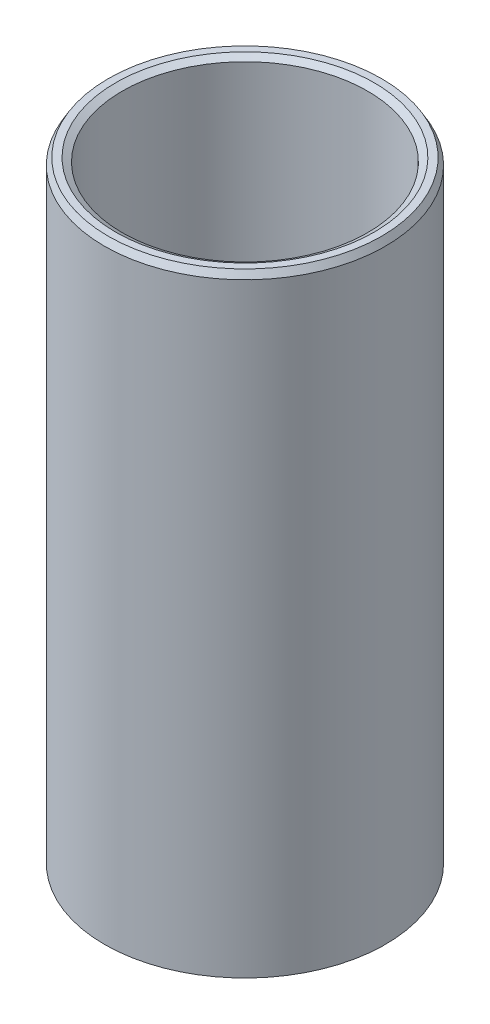
ISO-10303-21;
HEADER;
FILE_DESCRIPTION(('STEP AP214'),'2;1');
FILE_NAME('part.step','',(''),(''),'','','');
FILE_SCHEMA(('AUTOMOTIVE_DESIGN { 1 0 10303 214 1 1 1 1 }'));
ENDSEC;
DATA;
#1=APPLICATION_CONTEXT('core data for automotive mechanical design processes');
#2=APPLICATION_PROTOCOL_DEFINITION('international standard','automotive_design',2000,#1);
#3=PRODUCT_CONTEXT('',#1,'mechanical');
#4=PRODUCT('Part','Part','',(#3));
#5=PRODUCT_RELATED_PRODUCT_CATEGORY('part','',(#4));
#6=PRODUCT_DEFINITION_FORMATION('','',#4);
#7=PRODUCT_DEFINITION_CONTEXT('part definition',#1,'design');
#8=PRODUCT_DEFINITION('design','',#6,#7);
#9=PRODUCT_DEFINITION_SHAPE('','',#8);
#10=(LENGTH_UNIT() NAMED_UNIT(*) SI_UNIT(.MILLI.,.METRE.));
#11=(NAMED_UNIT(*) PLANE_ANGLE_UNIT() SI_UNIT($,.RADIAN.));
#12=(NAMED_UNIT(*) SI_UNIT($,.STERADIAN.) SOLID_ANGLE_UNIT());
#13=UNCERTAINTY_MEASURE_WITH_UNIT(LENGTH_MEASURE(1.E-05),#10,'distance_accuracy_value','');
#14=(GEOMETRIC_REPRESENTATION_CONTEXT(3) GLOBAL_UNCERTAINTY_ASSIGNED_CONTEXT((#13)) GLOBAL_UNIT_ASSIGNED_CONTEXT((#10,
#11,#12)) REPRESENTATION_CONTEXT('',''));
#15=CARTESIAN_POINT('',(0.,0.,0.));
#16=DIRECTION('',(0.,0.,1.));
#17=DIRECTION('',(1.,0.,0.));
#18=AXIS2_PLACEMENT_3D('',#15,#16,#17);
#19=CARTESIAN_POINT('',(0.,251.845150540965,0.));
#20=DIRECTION('',(0.,-1.,0.));
#21=DIRECTION('',(0.,0.,-1.));
#22=AXIS2_PLACEMENT_3D('',#19,#20,#21);
#23=CYLINDRICAL_SURFACE('',#22,57.5);
#24=CARTESIAN_POINT('',(0.,1.57675587139572,0.));
#25=DIRECTION('',(0.,1.,0.));
#26=DIRECTION('',(0.,0.,1.));
#27=AXIS2_PLACEMENT_3D('',#24,#25,#26);
#28=CIRCLE('',#27,57.5);
#29=CARTESIAN_POINT('',(0.,1.57675587139572,57.5));
#30=VERTEX_POINT('',#29);
#31=EDGE_CURVE('E10',#30,#30,#28,.T.);
#32=ORIENTED_EDGE('',*,*,#31,.T.);
#33=EDGE_LOOP('',(#32));
#34=FACE_BOUND('',#33,.T.);
#35=CARTESIAN_POINT('',(0.,249.114129260575,0.));
#36=DIRECTION('',(0.,1.,0.));
#37=DIRECTION('',(0.,0.,1.));
#38=AXIS2_PLACEMENT_3D('',#35,#36,#37);
#39=CIRCLE('',#38,57.5);
#40=CARTESIAN_POINT('',(0.,249.114129260575,57.5));
#41=VERTEX_POINT('',#40);
#42=EDGE_CURVE('E50',#41,#41,#39,.F.);
#43=ORIENTED_EDGE('',*,*,#42,.T.);
#44=EDGE_LOOP('',(#43));
#45=FACE_BOUND('',#44,.T.);
#46=ADVANCED_FACE('F39',(#34,#45),#23,.T.);
#47=CARTESIAN_POINT('',(0.,251.845150540965,0.));
#48=DIRECTION('',(0.,1.,0.));
#49=DIRECTION('',(0.,0.,1.));
#50=AXIS2_PLACEMENT_3D('',#47,#48,#49);
#51=PLANE('',#50);
#52=CARTESIAN_POINT('',(0.,251.845150540965,0.));
#53=DIRECTION('',(0.,1.,0.));
#54=DIRECTION('',(0.,0.,1.));
#55=AXIS2_PLACEMENT_3D('',#52,#53,#54);
#56=CIRCLE('',#55,52.9555222426381);
#57=CARTESIAN_POINT('',(0.,251.845150540965,52.9555222426381));
#58=VERTEX_POINT('',#57);
#59=EDGE_CURVE('E58',#58,#58,#56,.F.);
#60=ORIENTED_EDGE('',*,*,#59,.T.);
#61=EDGE_LOOP('',(#60));
#62=FACE_BOUND('',#61,.T.);
#63=CARTESIAN_POINT('',(0.,251.845150540965,0.));
#64=DIRECTION('',(0.,1.,0.));
#65=DIRECTION('',(0.,0.,1.));
#66=AXIS2_PLACEMENT_3D('',#63,#64,#65);
#67=CIRCLE('',#66,55.9232441286043);
#68=CARTESIAN_POINT('',(0.,251.845150540965,55.9232441286043));
#69=VERTEX_POINT('',#68);
#70=EDGE_CURVE('E61',#69,#69,#67,.T.);
#71=ORIENTED_EDGE('',*,*,#70,.T.);
#72=EDGE_LOOP('',(#71));
#73=FACE_BOUND('',#72,.T.);
#74=ADVANCED_FACE('F88',(#62,#73),#51,.T.);
#75=CARTESIAN_POINT('',(0.,0.,0.));
#76=DIRECTION('',(0.,1.,0.));
#77=DIRECTION('',(0.,0.,1.));
#78=AXIS2_PLACEMENT_3D('',#75,#76,#77);
#79=PLANE('',#78);
#80=CARTESIAN_POINT('',(0.,0.,0.));
#81=DIRECTION('',(0.,1.,0.));
#82=DIRECTION('',(0.,0.,1.));
#83=AXIS2_PLACEMENT_3D('',#80,#81,#82);
#84=CIRCLE('',#83,51.8012568336439);
#85=CARTESIAN_POINT('',(0.,0.,51.8012568336439));
#86=VERTEX_POINT('',#85);
#87=EDGE_CURVE('E51',#86,#86,#84,.T.);
#88=ORIENTED_EDGE('',*,*,#87,.T.);
#89=EDGE_LOOP('',(#88));
#90=FACE_BOUND('',#89,.T.);
#91=CARTESIAN_POINT('',(0.,0.,0.));
#92=DIRECTION('',(0.,1.,0.));
#93=DIRECTION('',(0.,0.,1.));
#94=AXIS2_PLACEMENT_3D('',#91,#92,#93);
#95=CIRCLE('',#94,54.7689787196101);
#96=CARTESIAN_POINT('',(0.,0.,54.7689787196101));
#97=VERTEX_POINT('',#96);
#98=EDGE_CURVE('E54',#97,#97,#95,.F.);
#99=ORIENTED_EDGE('',*,*,#98,.T.);
#100=EDGE_LOOP('',(#99));
#101=FACE_BOUND('',#100,.T.);
#102=ADVANCED_FACE('F83',(#90,#101),#79,.F.);
#103=CARTESIAN_POINT('',(0.,251.845150540965,0.));
#104=DIRECTION('',(0.,-1.,0.));
#105=DIRECTION('',(0.,0.,-1.));
#106=AXIS2_PLACEMENT_3D('',#103,#104,#105);
#107=CYLINDRICAL_SURFACE('',#106,50.2245009622482);
#108=CARTESIAN_POINT('',(0.,250.268394669569,0.));
#109=DIRECTION('',(0.,1.,0.));
#110=DIRECTION('',(0.,0.,1.));
#111=AXIS2_PLACEMENT_3D('',#108,#109,#110);
#112=CIRCLE('',#111,50.2245009622482);
#113=CARTESIAN_POINT('',(0.,250.268394669569,50.2245009622482));
#114=VERTEX_POINT('',#113);
#115=EDGE_CURVE('E67',#114,#114,#112,.T.);
#116=ORIENTED_EDGE('',*,*,#115,.T.);
#117=EDGE_LOOP('',(#116));
#118=FACE_BOUND('',#117,.T.);
#119=CARTESIAN_POINT('',(0.,2.73102128038999,0.));
#120=DIRECTION('',(0.,1.,0.));
#121=DIRECTION('',(0.,0.,1.));
#122=AXIS2_PLACEMENT_3D('',#119,#120,#121);
#123=CIRCLE('',#122,50.2245009622482);
#124=CARTESIAN_POINT('',(0.,2.73102128038999,50.2245009622482));
#125=VERTEX_POINT('',#124);
#126=EDGE_CURVE('E69',#125,#125,#123,.F.);
#127=ORIENTED_EDGE('',*,*,#126,.T.);
#128=EDGE_LOOP('',(#127));
#129=FACE_BOUND('',#128,.T.);
#130=ADVANCED_FACE('F71',(#118,#129),#107,.F.);
#131=CARTESIAN_POINT('',(0.,250.268394669569,0.));
#132=DIRECTION('',(0.,1.,0.));
#133=DIRECTION('',(0.,0.,1.));
#134=AXIS2_PLACEMENT_3D('',#131,#132,#133);
#135=CONICAL_SURFACE('',#134,50.2245009622482,1.04719755119659);
#136=CARTESIAN_POINT('',(0.,251.845150540965,52.9555222426381));
#137=CARTESIAN_POINT('',(0.,251.828726000638,52.9270741043007));
#138=CARTESIAN_POINT('',(0.,251.812301460311,52.8986259659633));
#139=CARTESIAN_POINT('',(0.,251.779452379657,52.8417296892885));
#140=CARTESIAN_POINT('',(0.,251.76302783933,52.8132815509511));
#141=CARTESIAN_POINT('',(0.,251.730178758676,52.7563852742763));
#142=CARTESIAN_POINT('',(0.,251.713754218349,52.7279371359389));
#143=CARTESIAN_POINT('',(0.,251.680905137694,52.6710408592641));
#144=CARTESIAN_POINT('',(0.,251.664480597367,52.6425927209267));
#145=CARTESIAN_POINT('',(0.,251.631631516713,52.5856964442519));
#146=CARTESIAN_POINT('',(0.,251.615206976386,52.5572483059145));
#147=CARTESIAN_POINT('',(0.,251.582357895732,52.5003520292397));
#148=CARTESIAN_POINT('',(0.,251.565933355405,52.4719038909024));
#149=CARTESIAN_POINT('',(0.,251.533084274751,52.4150076142276));
#150=CARTESIAN_POINT('',(0.,251.516659734424,52.3865594758902));
#151=CARTESIAN_POINT('',(0.,251.48381065377,52.3296631992154));
#152=CARTESIAN_POINT('',(0.,251.467386113443,52.301215060878));
#153=CARTESIAN_POINT('',(0.,251.434537032789,52.2443187842032));
#154=CARTESIAN_POINT('',(0.,251.418112492462,52.2158706458658));
#155=CARTESIAN_POINT('',(0.,251.385263411808,52.158974369191));
#156=CARTESIAN_POINT('',(0.,251.368838871481,52.1305262308536));
#157=CARTESIAN_POINT('',(0.,251.335989790827,52.0736299541788));
#158=CARTESIAN_POINT('',(0.,251.3195652505,52.0451818158414));
#159=CARTESIAN_POINT('',(0.,251.286716169846,51.9882855391666));
#160=CARTESIAN_POINT('',(0.,251.270291629518,51.9598374008292));
#161=CARTESIAN_POINT('',(0.,251.237442548864,51.9029411241545));
#162=CARTESIAN_POINT('',(0.,251.221018008537,51.8744929858171));
#163=CARTESIAN_POINT('',(0.,251.188168927883,51.8175967091423));
#164=CARTESIAN_POINT('',(0.,251.171744387556,51.7891485708049));
#165=CARTESIAN_POINT('',(0.,251.138895306902,51.7322522941301));
#166=CARTESIAN_POINT('',(0.,251.122470766575,51.7038041557927));
#167=CARTESIAN_POINT('',(0.,251.089621685921,51.6469078791179));
#168=CARTESIAN_POINT('',(0.,251.073197145594,51.6184597407805));
#169=CARTESIAN_POINT('',(0.,251.04034806494,51.5615634641057));
#170=CARTESIAN_POINT('',(0.,251.023923524613,51.5331153257683));
#171=CARTESIAN_POINT('',(0.,250.991074443959,51.4762190490935));
#172=CARTESIAN_POINT('',(0.,250.974649903632,51.4477709107561));
#173=CARTESIAN_POINT('',(0.,250.941800822978,51.3908746340813));
#174=CARTESIAN_POINT('',(0.,250.925376282651,51.362426495744));
#175=CARTESIAN_POINT('',(0.,250.892527201997,51.3055302190692));
#176=CARTESIAN_POINT('',(0.,250.87610266167,51.2770820807318));
#177=CARTESIAN_POINT('',(0.,250.843253581015,51.220185804057));
#178=CARTESIAN_POINT('',(0.,250.826829040688,51.1917376657196));
#179=CARTESIAN_POINT('',(0.,250.793979960034,51.1348413890448));
#180=CARTESIAN_POINT('',(0.,250.777555419707,51.1063932507074));
#181=CARTESIAN_POINT('',(0.,250.744706339053,51.0494969740326));
#182=CARTESIAN_POINT('',(0.,250.728281798726,51.0210488356952));
#183=CARTESIAN_POINT('',(0.,250.695432718072,50.9641525590204));
#184=CARTESIAN_POINT('',(0.,250.679008177745,50.935704420683));
#185=CARTESIAN_POINT('',(0.,250.646159097091,50.8788081440082));
#186=CARTESIAN_POINT('',(0.,250.629734556764,50.8503600056709));
#187=CARTESIAN_POINT('',(0.,250.59688547611,50.7934637289961));
#188=CARTESIAN_POINT('',(0.,250.580460935783,50.7650155906587));
#189=CARTESIAN_POINT('',(0.,250.547611855129,50.7081193139839));
#190=CARTESIAN_POINT('',(0.,250.531187314802,50.6796711756465));
#191=CARTESIAN_POINT('',(0.,250.498338234148,50.6227748989717));
#192=CARTESIAN_POINT('',(0.,250.481913693821,50.5943267606343));
#193=CARTESIAN_POINT('',(0.,250.449064613167,50.5374304839595));
#194=CARTESIAN_POINT('',(0.,250.432640072839,50.5089823456221));
#195=CARTESIAN_POINT('',(0.,250.399790992185,50.4520860689473));
#196=CARTESIAN_POINT('',(0.,250.383366451858,50.4236379306099));
#197=CARTESIAN_POINT('',(0.,250.350517371204,50.3667416539351));
#198=CARTESIAN_POINT('',(0.,250.334092830877,50.3382935155977));
#199=CARTESIAN_POINT('',(0.,250.301243750223,50.281397238923));
#200=CARTESIAN_POINT('',(0.,250.284819209896,50.2529491005856));
#201=CARTESIAN_POINT('',(0.,250.268394669569,50.2245009622482));
#202=B_SPLINE_CURVE_WITH_KNOTS('',3,(#136,#137,#138,#139,#140,#141,#142,#143,#144,#145,#146,
#147,#148,#149,#150,#151,#152,#153,#154,#155,#156,#157,#158,#159,#160,#161,#162,#163,#164,#165,
#166,#167,#168,#169,#170,#171,#172,#173,#174,#175,#176,#177,#178,#179,#180,#181,#182,#183,#184,
#185,#186,#187,#188,#189,#190,#191,#192,#193,#194,#195,#196,#197,#198,#199,#200,#201),
.UNSPECIFIED.,.F.,.F.,(4,2,2,2,2,2,2,2,2,2,2,2,2,2,2,2,2,2,2,2,2,2,2,2,2,2,2,2,2,2,2,2,4),(0.,
0.0985472419622327,0.197094483924465,0.295641725886692,0.394188967848925,0.492736209811158,
0.59128345177339,0.689830693735623,0.788377935697856,0.886925177660082,0.985472419622315,
1.08401966158455,1.18256690354678,1.28111414550901,1.37966138747125,1.47820862943348,
1.5767558713957,1.67530311335794,1.77385035532017,1.8723975972824,1.97094483924464,
2.06949208120687,2.1680393231691,2.26658656513133,2.36513380709356,2.46368104905579,
2.56222829101803,2.66077553298026,2.75932277494249,2.85787001690472,2.95641725886695,
3.05496450082918,3.15351174279139),.UNSPECIFIED.);
#203=EDGE_CURVE('BSEAM77',#58,#114,#202,.T.);
#204=ORIENTED_EDGE('',*,*,#59,.F.);
#205=ORIENTED_EDGE('',*,*,#115,.F.);
#206=ORIENTED_EDGE('',*,*,#203,.T.);
#207=ORIENTED_EDGE('',*,*,#203,.F.);
#208=EDGE_LOOP('',(#204,#206,#205,#207));
#209=FACE_BOUND('',#208,.T.);
#210=ADVANCED_FACE('F77',(#209),#135,.F.);
#211=CARTESIAN_POINT('',(0.,0.,0.));
#212=DIRECTION('',(0.,-1.,0.));
#213=DIRECTION('',(0.,0.,-1.));
#214=AXIS2_PLACEMENT_3D('',#211,#212,#213);
#215=CONICAL_SURFACE('',#214,51.8012568336439,0.523598775598294);
#216=ORIENTED_EDGE('',*,*,#126,.F.);
#217=EDGE_LOOP('',(#216));
#218=FACE_BOUND('',#217,.T.);
#219=ORIENTED_EDGE('',*,*,#87,.F.);
#220=EDGE_LOOP('',(#219));
#221=FACE_BOUND('',#220,.T.);
#222=ADVANCED_FACE('F73',(#218,#221),#215,.F.);
#223=CARTESIAN_POINT('',(0.,1.57675587139572,0.));
#224=DIRECTION('',(0.,1.,0.));
#225=DIRECTION('',(0.,0.,1.));
#226=AXIS2_PLACEMENT_3D('',#223,#224,#225);
#227=CONICAL_SURFACE('',#226,57.5,1.0471975511966);
#228=CARTESIAN_POINT('',(0.,0.,54.7689787196101));
#229=CARTESIAN_POINT('',(0.,0.0164245403270385,54.7974268579475));
#230=CARTESIAN_POINT('',(0.,0.0328490806540772,54.8258749962849));
#231=CARTESIAN_POINT('',(0.,0.0656981613081547,54.8827712729597));
#232=CARTESIAN_POINT('',(0.,0.0821227016351935,54.9112194112971));
#233=CARTESIAN_POINT('',(0.,0.114971782289271,54.9681156879719));
#234=CARTESIAN_POINT('',(0.,0.13139632261631,54.9965638263092));
#235=CARTESIAN_POINT('',(0.,0.164245403270387,55.053460102984));
#236=CARTESIAN_POINT('',(0.,0.180669943597426,55.0819082413214));
#237=CARTESIAN_POINT('',(0.,0.213519024251503,55.1388045179962));
#238=CARTESIAN_POINT('',(0.,0.229943564578541,55.1672526563336));
#239=CARTESIAN_POINT('',(0.,0.262792645232619,55.2241489330084));
#240=CARTESIAN_POINT('',(0.,0.279217185559659,55.2525970713458));
#241=CARTESIAN_POINT('',(0.,0.312066266213736,55.3094933480206));
#242=CARTESIAN_POINT('',(0.,0.328490806540775,55.337941486358));
#243=CARTESIAN_POINT('',(0.,0.361339887194852,55.3948377630328));
#244=CARTESIAN_POINT('',(0.,0.377764427521891,55.4232859013702));
#245=CARTESIAN_POINT('',(0.,0.410613508175968,55.480182178045));
#246=CARTESIAN_POINT('',(0.,0.427038048503007,55.5086303163823));
#247=CARTESIAN_POINT('',(0.,0.459887129157084,55.5655265930571));
#248=CARTESIAN_POINT('',(0.,0.476311669484123,55.5939747313945));
#249=CARTESIAN_POINT('',(0.,0.509160750138201,55.6508710080693));
#250=CARTESIAN_POINT('',(0.,0.525585290465239,55.6793191464067));
#251=CARTESIAN_POINT('',(0.,0.558434371119317,55.7362154230815));
#252=CARTESIAN_POINT('',(0.,0.574858911446356,55.7646635614189));
#253=CARTESIAN_POINT('',(0.,0.607707992100433,55.8215598380937));
#254=CARTESIAN_POINT('',(0.,0.624132532427472,55.8500079764311));
#255=CARTESIAN_POINT('',(0.,0.656981613081549,55.9069042531059));
#256=CARTESIAN_POINT('',(0.,0.673406153408588,55.9353523914433));
#257=CARTESIAN_POINT('',(0.,0.706255234062666,55.9922486681181));
#258=CARTESIAN_POINT('',(0.,0.722679774389704,56.0206968064555));
#259=CARTESIAN_POINT('',(0.,0.755528855043782,56.0775930831303));
#260=CARTESIAN_POINT('',(0.,0.77195339537082,56.1060412214676));
#261=CARTESIAN_POINT('',(0.,0.804802476024898,56.1629374981424));
#262=CARTESIAN_POINT('',(0.,0.821227016351937,56.1913856364798));
#263=CARTESIAN_POINT('',(0.,0.854076097006014,56.2482819131546));
#264=CARTESIAN_POINT('',(0.,0.870500637333053,56.276730051492));
#265=CARTESIAN_POINT('',(0.,0.90334971798713,56.3336263281668));
#266=CARTESIAN_POINT('',(0.,0.919774258314169,56.3620744665042));
#267=CARTESIAN_POINT('',(0.,0.952623338968247,56.418970743179));
#268=CARTESIAN_POINT('',(0.,0.969047879295285,56.4474188815164));
#269=CARTESIAN_POINT('',(0.,1.00189695994936,56.5043151581912));
#270=CARTESIAN_POINT('',(0.,1.0183215002764,56.5327632965286));
#271=CARTESIAN_POINT('',(0.,1.05117058093048,56.5896595732034));
#272=CARTESIAN_POINT('',(0.,1.06759512125752,56.6181077115408));
#273=CARTESIAN_POINT('',(0.,1.10044420191159,56.6750039882155));
#274=CARTESIAN_POINT('',(0.,1.11686874223863,56.7034521265529));
#275=CARTESIAN_POINT('',(0.,1.14971782289271,56.7603484032277));
#276=CARTESIAN_POINT('',(0.,1.16614236321975,56.7887965415651));
#277=CARTESIAN_POINT('',(0.,1.19899144387383,56.8456928182399));
#278=CARTESIAN_POINT('',(0.,1.21541598420087,56.8741409565773));
#279=CARTESIAN_POINT('',(0.,1.24826506485494,56.9310372332521));
#280=CARTESIAN_POINT('',(0.,1.26468960518198,56.9594853715895));
#281=CARTESIAN_POINT('',(0.,1.29753868583606,57.0163816482643));
#282=CARTESIAN_POINT('',(0.,1.3139632261631,57.0448297866017));
#283=CARTESIAN_POINT('',(0.,1.34681230681718,57.1017260632765));
#284=CARTESIAN_POINT('',(0.,1.36323684714422,57.1301742016139));
#285=CARTESIAN_POINT('',(0.,1.39608592779829,57.1870704782887));
#286=CARTESIAN_POINT('',(0.,1.41251046812533,57.215518616626));
#287=CARTESIAN_POINT('',(0.,1.44535954877941,57.2724148933008));
#288=CARTESIAN_POINT('',(0.,1.46178408910645,57.3008630316382));
#289=CARTESIAN_POINT('',(0.,1.49463316976052,57.357759308313));
#290=CARTESIAN_POINT('',(0.,1.51105771008756,57.3862074466504));
#291=CARTESIAN_POINT('',(0.,1.54390679074164,57.4431037233252));
#292=CARTESIAN_POINT('',(0.,1.56033133106868,57.4715518616626));
#293=CARTESIAN_POINT('',(0.,1.57675587139572,57.5));
#294=B_SPLINE_CURVE_WITH_KNOTS('',3,(#228,#229,#230,#231,#232,#233,#234,#235,#236,#237,#238,
#239,#240,#241,#242,#243,#244,#245,#246,#247,#248,#249,#250,#251,#252,#253,#254,#255,#256,#257,
#258,#259,#260,#261,#262,#263,#264,#265,#266,#267,#268,#269,#270,#271,#272,#273,#274,#275,#276,
#277,#278,#279,#280,#281,#282,#283,#284,#285,#286,#287,#288,#289,#290,#291,#292,#293),
.UNSPECIFIED.,.F.,.F.,(4,2,2,2,2,2,2,2,2,2,2,2,2,2,2,2,2,2,2,2,2,2,2,2,2,2,2,2,2,2,2,2,4),(0.,
0.0985472419622327,0.197094483924465,0.295641725886698,0.394188967848931,0.492736209811163,
0.59128345177339,0.689830693735623,0.788377935697856,0.886925177660088,0.985472419622321,
1.08401966158455,1.18256690354679,1.28111414550902,1.37966138747125,1.47820862943348,
1.57675587139572,1.67530311335795,1.77385035532018,1.87239759728241,1.97094483924465,
2.06949208120688,2.16803932316911,2.26658656513134,2.36513380709358,2.46368104905581,
2.56222829101804,2.66077553298027,2.7593227749425,2.85787001690474,2.95641725886697,
3.0549645008292,3.15351174279144),.UNSPECIFIED.);
#295=EDGE_CURVE('BSEAM76',#97,#30,#294,.T.);
#296=ORIENTED_EDGE('',*,*,#98,.F.);
#297=ORIENTED_EDGE('',*,*,#31,.F.);
#298=ORIENTED_EDGE('',*,*,#295,.T.);
#299=ORIENTED_EDGE('',*,*,#295,.F.);
#300=EDGE_LOOP('',(#296,#298,#297,#299));
#301=FACE_BOUND('',#300,.T.);
#302=ADVANCED_FACE('F76',(#301),#227,.T.);
#303=CARTESIAN_POINT('',(0.,251.845150540965,0.));
#304=DIRECTION('',(0.,-1.,0.));
#305=DIRECTION('',(0.,0.,-1.));
#306=AXIS2_PLACEMENT_3D('',#303,#304,#305);
#307=CONICAL_SURFACE('',#306,55.9232441286043,0.523598775598291);
#308=ORIENTED_EDGE('',*,*,#42,.F.);
#309=EDGE_LOOP('',(#308));
#310=FACE_BOUND('',#309,.T.);
#311=ORIENTED_EDGE('',*,*,#70,.F.);
#312=EDGE_LOOP('',(#311));
#313=FACE_BOUND('',#312,.T.);
#314=ADVANCED_FACE('F45',(#310,#313),#307,.T.);
#315=CLOSED_SHELL('',(#46,#74,#102,#130,#210,#222,#302,#314));
#316=MANIFOLD_SOLID_BREP('B2',#315);
#317=ADVANCED_BREP_SHAPE_REPRESENTATION('',(#18,#316),#14);
#318=SHAPE_DEFINITION_REPRESENTATION(#9,#317);
ENDSEC;
END-ISO-10303-21;
